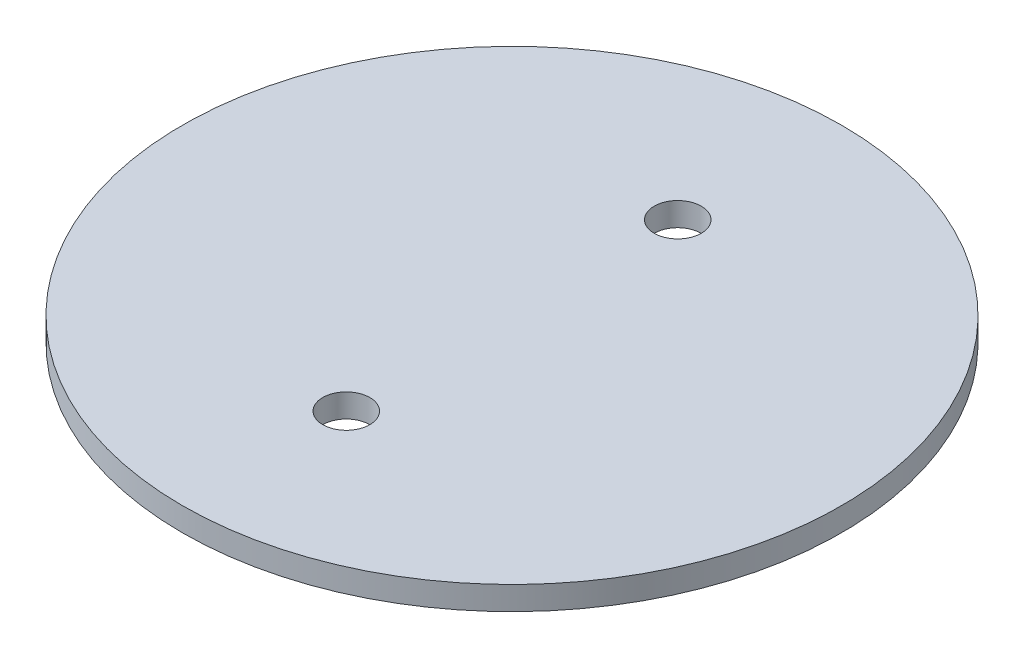
ISO-10303-21;
HEADER;
FILE_DESCRIPTION(('STEP AP214'),'2;1');
FILE_NAME('part.step','',(''),(''),'','','');
FILE_SCHEMA(('AUTOMOTIVE_DESIGN { 1 0 10303 214 1 1 1 1 }'));
ENDSEC;
DATA;
#1=APPLICATION_CONTEXT('core data for automotive mechanical design processes');
#2=APPLICATION_PROTOCOL_DEFINITION('international standard','automotive_design',2000,#1);
#3=PRODUCT_CONTEXT('',#1,'mechanical');
#4=PRODUCT('Part','Part','',(#3));
#5=PRODUCT_RELATED_PRODUCT_CATEGORY('part','',(#4));
#6=PRODUCT_DEFINITION_FORMATION('','',#4);
#7=PRODUCT_DEFINITION_CONTEXT('part definition',#1,'design');
#8=PRODUCT_DEFINITION('design','',#6,#7);
#9=PRODUCT_DEFINITION_SHAPE('','',#8);
#10=(LENGTH_UNIT() NAMED_UNIT(*) SI_UNIT(.MILLI.,.METRE.));
#11=(NAMED_UNIT(*) PLANE_ANGLE_UNIT() SI_UNIT($,.RADIAN.));
#12=(NAMED_UNIT(*) SI_UNIT($,.STERADIAN.) SOLID_ANGLE_UNIT());
#13=UNCERTAINTY_MEASURE_WITH_UNIT(LENGTH_MEASURE(1.E-05),#10,'distance_accuracy_value','');
#14=(GEOMETRIC_REPRESENTATION_CONTEXT(3) GLOBAL_UNCERTAINTY_ASSIGNED_CONTEXT((#13)) GLOBAL_UNIT_ASSIGNED_CONTEXT((#10,
#11,#12)) REPRESENTATION_CONTEXT('',''));
#15=CARTESIAN_POINT('',(0.,0.,0.));
#16=DIRECTION('',(0.,0.,1.));
#17=DIRECTION('',(1.,0.,0.));
#18=AXIS2_PLACEMENT_3D('',#15,#16,#17);
#19=CARTESIAN_POINT('',(0.,3.175,0.));
#20=DIRECTION('',(0.,-1.,0.));
#21=DIRECTION('',(0.,0.,-1.));
#22=AXIS2_PLACEMENT_3D('',#19,#20,#21);
#23=CYLINDRICAL_SURFACE('',#22,44.45);
#24=CARTESIAN_POINT('',(0.,3.175,0.));
#25=DIRECTION('',(0.,1.,0.));
#26=DIRECTION('',(0.,0.,1.));
#27=AXIS2_PLACEMENT_3D('',#24,#25,#26);
#28=CIRCLE('',#27,44.45);
#29=CARTESIAN_POINT('',(0.,3.175,44.45));
#30=VERTEX_POINT('',#29);
#31=EDGE_CURVE('E54',#30,#30,#28,.T.);
#32=ORIENTED_EDGE('',*,*,#31,.F.);
#33=EDGE_LOOP('',(#32));
#34=FACE_BOUND('',#33,.T.);
#35=CARTESIAN_POINT('',(0.,0.,0.));
#36=DIRECTION('',(0.,1.,0.));
#37=DIRECTION('',(0.,0.,1.));
#38=AXIS2_PLACEMENT_3D('',#35,#36,#37);
#39=CIRCLE('',#38,44.45);
#40=CARTESIAN_POINT('',(0.,0.,44.45));
#41=VERTEX_POINT('',#40);
#42=EDGE_CURVE('E67',#41,#41,#39,.T.);
#43=ORIENTED_EDGE('',*,*,#42,.T.);
#44=EDGE_LOOP('',(#43));
#45=FACE_BOUND('',#44,.T.);
#46=ADVANCED_FACE('F45',(#34,#45),#23,.T.);
#47=CARTESIAN_POINT('',(0.,3.175,22.352));
#48=DIRECTION('',(0.,-1.,0.));
#49=DIRECTION('',(0.,0.,-1.));
#50=AXIS2_PLACEMENT_3D('',#47,#48,#49);
#51=CYLINDRICAL_SURFACE('',#50,3.175);
#52=CARTESIAN_POINT('',(0.,3.175,22.352));
#53=DIRECTION('',(0.,1.,0.));
#54=DIRECTION('',(0.,0.,1.));
#55=AXIS2_PLACEMENT_3D('',#52,#53,#54);
#56=CIRCLE('',#55,3.175);
#57=CARTESIAN_POINT('',(0.,3.175,25.527));
#58=VERTEX_POINT('',#57);
#59=EDGE_CURVE('E60',#58,#58,#56,.T.);
#60=ORIENTED_EDGE('',*,*,#59,.T.);
#61=EDGE_LOOP('',(#60));
#62=FACE_BOUND('',#61,.T.);
#63=CARTESIAN_POINT('',(0.,0.,22.352));
#64=DIRECTION('',(0.,1.,0.));
#65=DIRECTION('',(0.,0.,1.));
#66=AXIS2_PLACEMENT_3D('',#63,#64,#65);
#67=CIRCLE('',#66,3.175);
#68=CARTESIAN_POINT('',(0.,0.,25.527));
#69=VERTEX_POINT('',#68);
#70=EDGE_CURVE('E64',#69,#69,#67,.T.);
#71=ORIENTED_EDGE('',*,*,#70,.F.);
#72=EDGE_LOOP('',(#71));
#73=FACE_BOUND('',#72,.T.);
#74=ADVANCED_FACE('F47',(#62,#73),#51,.F.);
#75=CARTESIAN_POINT('',(0.,3.175,-22.352));
#76=DIRECTION('',(0.,-1.,0.));
#77=DIRECTION('',(0.,0.,-1.));
#78=AXIS2_PLACEMENT_3D('',#75,#76,#77);
#79=CYLINDRICAL_SURFACE('',#78,3.175);
#80=CARTESIAN_POINT('',(0.,3.175,-22.352));
#81=DIRECTION('',(0.,1.,0.));
#82=DIRECTION('',(0.,0.,1.));
#83=AXIS2_PLACEMENT_3D('',#80,#81,#82);
#84=CIRCLE('',#83,3.175);
#85=CARTESIAN_POINT('',(0.,3.175,-19.177));
#86=VERTEX_POINT('',#85);
#87=EDGE_CURVE('E10',#86,#86,#84,.F.);
#88=ORIENTED_EDGE('',*,*,#87,.F.);
#89=EDGE_LOOP('',(#88));
#90=FACE_BOUND('',#89,.T.);
#91=CARTESIAN_POINT('',(0.,0.,-22.352));
#92=DIRECTION('',(0.,1.,0.));
#93=DIRECTION('',(0.,0.,1.));
#94=AXIS2_PLACEMENT_3D('',#91,#92,#93);
#95=CIRCLE('',#94,3.175);
#96=CARTESIAN_POINT('',(0.,0.,-19.177));
#97=VERTEX_POINT('',#96);
#98=EDGE_CURVE('E49',#97,#97,#95,.F.);
#99=ORIENTED_EDGE('',*,*,#98,.T.);
#100=EDGE_LOOP('',(#99));
#101=FACE_BOUND('',#100,.T.);
#102=ADVANCED_FACE('F86',(#90,#101),#79,.F.);
#103=CARTESIAN_POINT('',(0.,3.175,0.));
#104=DIRECTION('',(0.,1.,0.));
#105=DIRECTION('',(0.,0.,1.));
#106=AXIS2_PLACEMENT_3D('',#103,#104,#105);
#107=PLANE('',#106);
#108=ORIENTED_EDGE('',*,*,#59,.F.);
#109=EDGE_LOOP('',(#108));
#110=FACE_BOUND('',#109,.T.);
#111=ORIENTED_EDGE('',*,*,#31,.T.);
#112=EDGE_LOOP('',(#111));
#113=FACE_BOUND('',#112,.T.);
#114=ORIENTED_EDGE('',*,*,#87,.T.);
#115=EDGE_LOOP('',(#114));
#116=FACE_BOUND('',#115,.T.);
#117=ADVANCED_FACE('F82',(#110,#113,#116),#107,.T.);
#118=CARTESIAN_POINT('',(0.,0.,0.));
#119=DIRECTION('',(0.,1.,0.));
#120=DIRECTION('',(0.,0.,1.));
#121=AXIS2_PLACEMENT_3D('',#118,#119,#120);
#122=PLANE('',#121);
#123=ORIENTED_EDGE('',*,*,#70,.T.);
#124=EDGE_LOOP('',(#123));
#125=FACE_BOUND('',#124,.T.);
#126=ORIENTED_EDGE('',*,*,#42,.F.);
#127=EDGE_LOOP('',(#126));
#128=FACE_BOUND('',#127,.T.);
#129=ORIENTED_EDGE('',*,*,#98,.F.);
#130=EDGE_LOOP('',(#129));
#131=FACE_BOUND('',#130,.T.);
#132=ADVANCED_FACE('F85',(#125,#128,#131),#122,.F.);
#133=CLOSED_SHELL('',(#46,#74,#102,#117,#132));
#134=MANIFOLD_SOLID_BREP('B2',#133);
#135=ADVANCED_BREP_SHAPE_REPRESENTATION('',(#18,#134),#14);
#136=SHAPE_DEFINITION_REPRESENTATION(#9,#135);
ENDSEC;
END-ISO-10303-21;
